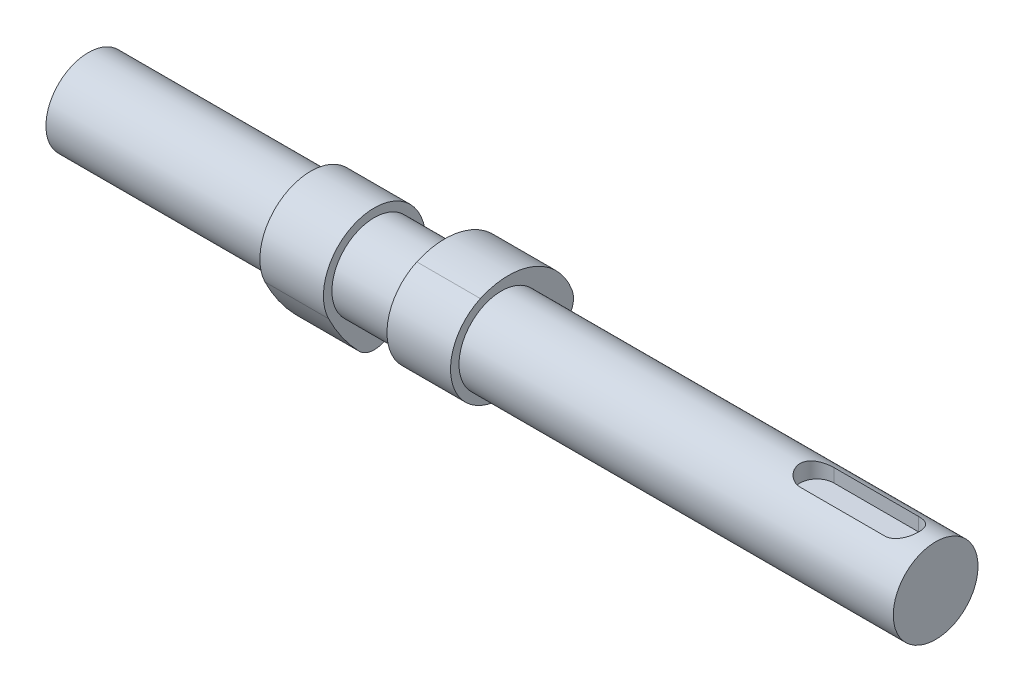
ISO-10303-21;
HEADER;
FILE_DESCRIPTION(('STEP AP214'),'2;1');
FILE_NAME('part.step','',(''),(''),'','','');
FILE_SCHEMA(('AUTOMOTIVE_DESIGN { 1 0 10303 214 1 1 1 1 }'));
ENDSEC;
DATA;
#1=APPLICATION_CONTEXT('core data for automotive mechanical design processes');
#2=APPLICATION_PROTOCOL_DEFINITION('international standard','automotive_design',2000,#1);
#3=PRODUCT_CONTEXT('',#1,'mechanical');
#4=PRODUCT('Part','Part','',(#3));
#5=PRODUCT_RELATED_PRODUCT_CATEGORY('part','',(#4));
#6=PRODUCT_DEFINITION_FORMATION('','',#4);
#7=PRODUCT_DEFINITION_CONTEXT('part definition',#1,'design');
#8=PRODUCT_DEFINITION('design','',#6,#7);
#9=PRODUCT_DEFINITION_SHAPE('','',#8);
#10=(LENGTH_UNIT() NAMED_UNIT(*) SI_UNIT(.MILLI.,.METRE.));
#11=(NAMED_UNIT(*) PLANE_ANGLE_UNIT() SI_UNIT($,.RADIAN.));
#12=(NAMED_UNIT(*) SI_UNIT($,.STERADIAN.) SOLID_ANGLE_UNIT());
#13=UNCERTAINTY_MEASURE_WITH_UNIT(LENGTH_MEASURE(1.E-05),#10,'distance_accuracy_value','');
#14=(GEOMETRIC_REPRESENTATION_CONTEXT(3) GLOBAL_UNCERTAINTY_ASSIGNED_CONTEXT((#13)) GLOBAL_UNIT_ASSIGNED_CONTEXT((#10,
#11,#12)) REPRESENTATION_CONTEXT('',''));
#15=CARTESIAN_POINT('',(0.,0.,0.));
#16=DIRECTION('',(0.,0.,1.));
#17=DIRECTION('',(1.,0.,0.));
#18=AXIS2_PLACEMENT_3D('',#15,#16,#17);
#19=CARTESIAN_POINT('',(-7.5,-1.65027279490968,3.64370686285011));
#20=DIRECTION('',(-1.,0.,0.));
#21=DIRECTION('',(0.,1.,0.));
#22=AXIS2_PLACEMENT_3D('',#19,#20,#21);
#23=CYLINDRICAL_SURFACE('',#22,16.);
#24=CARTESIAN_POINT('',(-22.5,-1.65027279490968,3.64370686285011));
#25=DIRECTION('',(1.,0.,0.));
#26=DIRECTION('',(0.,1.,0.));
#27=AXIS2_PLACEMENT_3D('',#24,#25,#26);
#28=CIRCLE('',#27,16.);
#29=CARTESIAN_POINT('',(-22.5,-16.7469832012361,-1.65623039220453));
#30=VERTEX_POINT('',#29);
#31=CARTESIAN_POINT('',(-22.5,4.95081838472905,-10.9311205885503));
#32=VERTEX_POINT('',#31);
#33=EDGE_CURVE('E107',#30,#32,#28,.T.);
#34=ORIENTED_EDGE('',*,*,#33,.T.);
#35=DIRECTION('',(-1.,0.,0.));
#36=VECTOR('',#35,1.);
#37=CARTESIAN_POINT('',(-7.5,4.95081838472905,-10.9311205885503));
#38=LINE('',#37,#36);
#39=CARTESIAN_POINT('',(-7.5,4.95081838472905,-10.9311205885503));
#40=VERTEX_POINT('',#39);
#41=EDGE_CURVE('E12',#40,#32,#38,.T.);
#42=ORIENTED_EDGE('',*,*,#41,.F.);
#43=CARTESIAN_POINT('',(-7.5,-1.65027279490968,3.64370686285011));
#44=DIRECTION('',(1.,0.,0.));
#45=DIRECTION('',(0.,1.,0.));
#46=AXIS2_PLACEMENT_3D('',#43,#44,#45);
#47=CIRCLE('',#46,16.);
#48=CARTESIAN_POINT('',(-7.5,-16.7469832012361,-1.65623039220453));
#49=VERTEX_POINT('',#48);
#50=EDGE_CURVE('E95',#49,#40,#47,.T.);
#51=ORIENTED_EDGE('',*,*,#50,.F.);
#52=DIRECTION('',(-1.,0.,0.));
#53=VECTOR('',#52,1.);
#54=CARTESIAN_POINT('',(-7.5,-16.7469832012361,-1.65623039220453));
#55=LINE('',#54,#53);
#56=EDGE_CURVE('E103',#49,#30,#55,.T.);
#57=ORIENTED_EDGE('',*,*,#56,.T.);
#58=EDGE_LOOP('',(#34,#42,#51,#57));
#59=FACE_BOUND('',#58,.T.);
#60=ADVANCED_FACE('F44',(#59),#23,.T.);
#61=CARTESIAN_POINT('',(-7.5,0.,0.));
#62=DIRECTION('',(-1.,0.,0.));
#63=DIRECTION('',(0.,1.,0.));
#64=AXIS2_PLACEMENT_3D('',#61,#62,#63);
#65=CYLINDRICAL_SURFACE('',#64,12.);
#66=CARTESIAN_POINT('',(-22.5,0.,0.));
#67=DIRECTION('',(1.,0.,0.));
#68=DIRECTION('',(0.,-1.,0.));
#69=AXIS2_PLACEMENT_3D('',#66,#67,#68);
#70=CIRCLE('',#69,12.);
#71=CARTESIAN_POINT('',(-22.5,-5.27814522008303,10.7768818790833));
#72=VERTEX_POINT('',#71);
#73=EDGE_CURVE('E99',#32,#72,#70,.T.);
#74=ORIENTED_EDGE('',*,*,#73,.T.);
#75=DIRECTION('',(-1.,0.,0.));
#76=VECTOR('',#75,1.);
#77=CARTESIAN_POINT('',(-7.5,-5.27814522008303,10.7768818790833));
#78=LINE('',#77,#76);
#79=CARTESIAN_POINT('',(-7.5,-5.27814522008303,10.7768818790833));
#80=VERTEX_POINT('',#79);
#81=EDGE_CURVE('E52',#80,#72,#78,.T.);
#82=ORIENTED_EDGE('',*,*,#81,.F.);
#83=CARTESIAN_POINT('',(-7.5,0.,0.));
#84=DIRECTION('',(1.,0.,0.));
#85=DIRECTION('',(0.,-1.,0.));
#86=AXIS2_PLACEMENT_3D('',#83,#84,#85);
#87=CIRCLE('',#86,12.);
#88=EDGE_CURVE('E90',#40,#80,#87,.T.);
#89=ORIENTED_EDGE('',*,*,#88,.F.);
#90=ORIENTED_EDGE('',*,*,#41,.T.);
#91=EDGE_LOOP('',(#74,#82,#89,#90));
#92=FACE_BOUND('',#91,.T.);
#93=ADVANCED_FACE('F98',(#92),#65,.T.);
#94=CARTESIAN_POINT('',(-7.5,12.3156721801937,-25.1460577178611));
#95=DIRECTION('',(-1.,0.,0.));
#96=DIRECTION('',(0.,1.,0.));
#97=AXIS2_PLACEMENT_3D('',#94,#95,#96);
#98=CYLINDRICAL_SURFACE('',#97,40.);
#99=CARTESIAN_POINT('',(-22.5,12.3156721801937,-25.1460577178611));
#100=DIRECTION('',(1.,0.,0.));
#101=DIRECTION('',(0.,-1.,0.));
#102=AXIS2_PLACEMENT_3D('',#99,#100,#101);
#103=CIRCLE('',#102,40.);
#104=CARTESIAN_POINT('',(-22.5,-15.5071088248952,3.59229395969449));
#105=VERTEX_POINT('',#104);
#106=EDGE_CURVE('E77',#72,#105,#103,.T.);
#107=ORIENTED_EDGE('',*,*,#106,.T.);
#108=DIRECTION('',(-1.,0.,0.));
#109=VECTOR('',#108,1.);
#110=CARTESIAN_POINT('',(-7.5,-15.5071088248952,3.59229395969449));
#111=LINE('',#110,#109);
#112=CARTESIAN_POINT('',(-7.5,-15.5071088248952,3.59229395969449));
#113=VERTEX_POINT('',#112);
#114=EDGE_CURVE('E100',#113,#105,#111,.T.);
#115=ORIENTED_EDGE('',*,*,#114,.F.);
#116=CARTESIAN_POINT('',(-7.5,12.3156721801937,-25.1460577178611));
#117=DIRECTION('',(1.,0.,0.));
#118=DIRECTION('',(0.,-1.,0.));
#119=AXIS2_PLACEMENT_3D('',#116,#117,#118);
#120=CIRCLE('',#119,40.);
#121=EDGE_CURVE('E93',#80,#113,#120,.T.);
#122=ORIENTED_EDGE('',*,*,#121,.F.);
#123=ORIENTED_EDGE('',*,*,#81,.T.);
#124=EDGE_LOOP('',(#107,#115,#122,#123));
#125=FACE_BOUND('',#124,.T.);
#126=ADVANCED_FACE('F101',(#125),#98,.T.);
#127=CARTESIAN_POINT('',(-7.5,-12.0292611992591,0.));
#128=DIRECTION('',(-1.,0.,0.));
#129=DIRECTION('',(0.,1.,0.));
#130=AXIS2_PLACEMENT_3D('',#127,#128,#129);
#131=CYLINDRICAL_SURFACE('',#130,4.99999999999999);
#132=CARTESIAN_POINT('',(-22.5,-12.0292611992591,0.));
#133=DIRECTION('',(1.,0.,0.));
#134=DIRECTION('',(0.,-1.,0.));
#135=AXIS2_PLACEMENT_3D('',#132,#133,#134);
#136=CIRCLE('',#135,4.99999999999999);
#137=EDGE_CURVE('E83',#105,#30,#136,.T.);
#138=ORIENTED_EDGE('',*,*,#137,.T.);
#139=ORIENTED_EDGE('',*,*,#56,.F.);
#140=CARTESIAN_POINT('',(-7.5,-12.0292611992591,0.));
#141=DIRECTION('',(1.,0.,0.));
#142=DIRECTION('',(0.,-1.,0.));
#143=AXIS2_PLACEMENT_3D('',#140,#141,#142);
#144=CIRCLE('',#143,4.99999999999999);
#145=EDGE_CURVE('E60',#113,#49,#144,.T.);
#146=ORIENTED_EDGE('',*,*,#145,.F.);
#147=ORIENTED_EDGE('',*,*,#114,.T.);
#148=EDGE_LOOP('',(#138,#139,#146,#147));
#149=FACE_BOUND('',#148,.T.);
#150=ADVANCED_FACE('F114',(#149),#131,.T.);
#151=CARTESIAN_POINT('',(-7.5,-6.83976699708438,1.82185343142508));
#152=DIRECTION('',(-1.,0.,0.));
#153=DIRECTION('',(0.,1.,0.));
#154=AXIS2_PLACEMENT_3D('',#151,#152,#153);
#155=PLANE('',#154);
#156=ORIENTED_EDGE('',*,*,#50,.T.);
#157=ORIENTED_EDGE('',*,*,#88,.T.);
#158=ORIENTED_EDGE('',*,*,#121,.T.);
#159=ORIENTED_EDGE('',*,*,#145,.T.);
#160=EDGE_LOOP('',(#156,#157,#158,#159));
#161=FACE_BOUND('',#160,.T.);
#162=ADVANCED_FACE('F91',(#161),#155,.F.);
#163=CARTESIAN_POINT('',(-22.5,-6.83976699708438,1.82185343142508));
#164=DIRECTION('',(-1.,0.,0.));
#165=DIRECTION('',(0.,1.,0.));
#166=AXIS2_PLACEMENT_3D('',#163,#164,#165);
#167=PLANE('',#166);
#168=ORIENTED_EDGE('',*,*,#33,.F.);
#169=ORIENTED_EDGE('',*,*,#137,.F.);
#170=ORIENTED_EDGE('',*,*,#106,.F.);
#171=ORIENTED_EDGE('',*,*,#73,.F.);
#172=EDGE_LOOP('',(#168,#169,#170,#171));
#173=FACE_BOUND('',#172,.T.);
#174=ADVANCED_FACE('F117',(#173),#167,.T.);
#175=CLOSED_SHELL('',(#60,#93,#126,#150,#162,#174));
#176=MANIFOLD_SOLID_BREP('B2',#175);
#177=CARTESIAN_POINT('',(22.5,-3.6437068628501,-1.6502727949097));
#178=DIRECTION('',(-1.,0.,0.));
#179=DIRECTION('',(0.,0.,1.));
#180=AXIS2_PLACEMENT_3D('',#177,#178,#179);
#181=CYLINDRICAL_SURFACE('',#180,16.);
#182=CARTESIAN_POINT('',(7.5,-3.6437068628501,-1.6502727949097));
#183=DIRECTION('',(1.,0.,0.));
#184=DIRECTION('',(0.,0.,1.));
#185=AXIS2_PLACEMENT_3D('',#182,#183,#184);
#186=CIRCLE('',#185,16.);
#187=CARTESIAN_POINT('',(7.5,1.65623039220459,-16.7469832012361));
#188=VERTEX_POINT('',#187);
#189=CARTESIAN_POINT('',(7.5,10.9311205885503,4.95081838472909));
#190=VERTEX_POINT('',#189);
#191=EDGE_CURVE('E240',#188,#190,#186,.T.);
#192=ORIENTED_EDGE('',*,*,#191,.T.);
#193=DIRECTION('',(-1.,0.,0.));
#194=VECTOR('',#193,1.);
#195=CARTESIAN_POINT('',(22.5,10.9311205885503,4.95081838472909));
#196=LINE('',#195,#194);
#197=CARTESIAN_POINT('',(22.5,10.9311205885503,4.95081838472909));
#198=VERTEX_POINT('',#197);
#199=EDGE_CURVE('E42',#198,#190,#196,.T.);
#200=ORIENTED_EDGE('',*,*,#199,.F.);
#201=CARTESIAN_POINT('',(22.5,-3.6437068628501,-1.6502727949097));
#202=DIRECTION('',(1.,0.,0.));
#203=DIRECTION('',(0.,0.,1.));
#204=AXIS2_PLACEMENT_3D('',#201,#202,#203);
#205=CIRCLE('',#204,16.);
#206=CARTESIAN_POINT('',(22.5,1.65623039220459,-16.7469832012361));
#207=VERTEX_POINT('',#206);
#208=EDGE_CURVE('E228',#207,#198,#205,.T.);
#209=ORIENTED_EDGE('',*,*,#208,.F.);
#210=DIRECTION('',(-1.,0.,0.));
#211=VECTOR('',#210,1.);
#212=CARTESIAN_POINT('',(22.5,1.65623039220459,-16.7469832012361));
#213=LINE('',#212,#211);
#214=EDGE_CURVE('E236',#207,#188,#213,.T.);
#215=ORIENTED_EDGE('',*,*,#214,.T.);
#216=EDGE_LOOP('',(#192,#200,#209,#215));
#217=FACE_BOUND('',#216,.T.);
#218=ADVANCED_FACE('F177',(#217),#181,.T.);
#219=CARTESIAN_POINT('',(22.5,0.,0.));
#220=DIRECTION('',(-1.,0.,0.));
#221=DIRECTION('',(0.,0.,1.));
#222=AXIS2_PLACEMENT_3D('',#219,#220,#221);
#223=CYLINDRICAL_SURFACE('',#222,12.);
#224=CARTESIAN_POINT('',(7.5,0.,0.));
#225=DIRECTION('',(1.,0.,0.));
#226=DIRECTION('',(0.,0.,-1.));
#227=AXIS2_PLACEMENT_3D('',#224,#225,#226);
#228=CIRCLE('',#227,12.);
#229=CARTESIAN_POINT('',(7.5,-10.7768818790833,-5.27814522008307));
#230=VERTEX_POINT('',#229);
#231=EDGE_CURVE('E232',#190,#230,#228,.T.);
#232=ORIENTED_EDGE('',*,*,#231,.T.);
#233=DIRECTION('',(-1.,0.,0.));
#234=VECTOR('',#233,1.);
#235=CARTESIAN_POINT('',(22.5,-10.7768818790833,-5.27814522008307));
#236=LINE('',#235,#234);
#237=CARTESIAN_POINT('',(22.5,-10.7768818790833,-5.27814522008307));
#238=VERTEX_POINT('',#237);
#239=EDGE_CURVE('E185',#238,#230,#236,.T.);
#240=ORIENTED_EDGE('',*,*,#239,.F.);
#241=CARTESIAN_POINT('',(22.5,0.,0.));
#242=DIRECTION('',(1.,0.,0.));
#243=DIRECTION('',(0.,0.,-1.));
#244=AXIS2_PLACEMENT_3D('',#241,#242,#243);
#245=CIRCLE('',#244,12.);
#246=EDGE_CURVE('E223',#198,#238,#245,.T.);
#247=ORIENTED_EDGE('',*,*,#246,.F.);
#248=ORIENTED_EDGE('',*,*,#199,.T.);
#249=EDGE_LOOP('',(#232,#240,#247,#248));
#250=FACE_BOUND('',#249,.T.);
#251=ADVANCED_FACE('F231',(#250),#223,.T.);
#252=CARTESIAN_POINT('',(22.5,25.1460577178611,12.3156721801938));
#253=DIRECTION('',(-1.,0.,0.));
#254=DIRECTION('',(0.,0.,1.));
#255=AXIS2_PLACEMENT_3D('',#252,#253,#254);
#256=CYLINDRICAL_SURFACE('',#255,40.);
#257=CARTESIAN_POINT('',(7.5,25.1460577178611,12.3156721801938));
#258=DIRECTION('',(1.,0.,0.));
#259=DIRECTION('',(0.,0.,-1.));
#260=AXIS2_PLACEMENT_3D('',#257,#258,#259);
#261=CIRCLE('',#260,40.);
#262=CARTESIAN_POINT('',(7.5,-3.59229395969443,-15.5071088248952));
#263=VERTEX_POINT('',#262);
#264=EDGE_CURVE('E210',#230,#263,#261,.T.);
#265=ORIENTED_EDGE('',*,*,#264,.T.);
#266=DIRECTION('',(-1.,0.,0.));
#267=VECTOR('',#266,1.);
#268=CARTESIAN_POINT('',(22.5,-3.59229395969443,-15.5071088248952));
#269=LINE('',#268,#267);
#270=CARTESIAN_POINT('',(22.5,-3.59229395969443,-15.5071088248952));
#271=VERTEX_POINT('',#270);
#272=EDGE_CURVE('E233',#271,#263,#269,.T.);
#273=ORIENTED_EDGE('',*,*,#272,.F.);
#274=CARTESIAN_POINT('',(22.5,25.1460577178611,12.3156721801938));
#275=DIRECTION('',(1.,0.,0.));
#276=DIRECTION('',(0.,0.,-1.));
#277=AXIS2_PLACEMENT_3D('',#274,#275,#276);
#278=CIRCLE('',#277,40.);
#279=EDGE_CURVE('E226',#238,#271,#278,.T.);
#280=ORIENTED_EDGE('',*,*,#279,.F.);
#281=ORIENTED_EDGE('',*,*,#239,.T.);
#282=EDGE_LOOP('',(#265,#273,#280,#281));
#283=FACE_BOUND('',#282,.T.);
#284=ADVANCED_FACE('F234',(#283),#256,.T.);
#285=CARTESIAN_POINT('',(22.5,0.,-12.0292611992591));
#286=DIRECTION('',(-1.,0.,0.));
#287=DIRECTION('',(0.,0.,1.));
#288=AXIS2_PLACEMENT_3D('',#285,#286,#287);
#289=CYLINDRICAL_SURFACE('',#288,4.99999999999999);
#290=CARTESIAN_POINT('',(7.5,0.,-12.0292611992591));
#291=DIRECTION('',(1.,0.,0.));
#292=DIRECTION('',(0.,0.,-1.));
#293=AXIS2_PLACEMENT_3D('',#290,#291,#292);
#294=CIRCLE('',#293,4.99999999999999);
#295=EDGE_CURVE('E216',#263,#188,#294,.T.);
#296=ORIENTED_EDGE('',*,*,#295,.T.);
#297=ORIENTED_EDGE('',*,*,#214,.F.);
#298=CARTESIAN_POINT('',(22.5,0.,-12.0292611992591));
#299=DIRECTION('',(1.,0.,0.));
#300=DIRECTION('',(0.,0.,-1.));
#301=AXIS2_PLACEMENT_3D('',#298,#299,#300);
#302=CIRCLE('',#301,4.99999999999999);
#303=EDGE_CURVE('E193',#271,#207,#302,.T.);
#304=ORIENTED_EDGE('',*,*,#303,.F.);
#305=ORIENTED_EDGE('',*,*,#272,.T.);
#306=EDGE_LOOP('',(#296,#297,#304,#305));
#307=FACE_BOUND('',#306,.T.);
#308=ADVANCED_FACE('F247',(#307),#289,.T.);
#309=CARTESIAN_POINT('',(22.5,-1.82185343142505,-6.83976699708439));
#310=DIRECTION('',(-1.,0.,0.));
#311=DIRECTION('',(0.,0.,1.));
#312=AXIS2_PLACEMENT_3D('',#309,#310,#311);
#313=PLANE('',#312);
#314=ORIENTED_EDGE('',*,*,#208,.T.);
#315=ORIENTED_EDGE('',*,*,#246,.T.);
#316=ORIENTED_EDGE('',*,*,#279,.T.);
#317=ORIENTED_EDGE('',*,*,#303,.T.);
#318=EDGE_LOOP('',(#314,#315,#316,#317));
#319=FACE_BOUND('',#318,.T.);
#320=ADVANCED_FACE('F224',(#319),#313,.F.);
#321=CARTESIAN_POINT('',(7.5,-1.82185343142505,-6.83976699708439));
#322=DIRECTION('',(-1.,0.,0.));
#323=DIRECTION('',(0.,0.,1.));
#324=AXIS2_PLACEMENT_3D('',#321,#322,#323);
#325=PLANE('',#324);
#326=ORIENTED_EDGE('',*,*,#191,.F.);
#327=ORIENTED_EDGE('',*,*,#295,.F.);
#328=ORIENTED_EDGE('',*,*,#264,.F.);
#329=ORIENTED_EDGE('',*,*,#231,.F.);
#330=EDGE_LOOP('',(#326,#327,#328,#329));
#331=FACE_BOUND('',#330,.T.);
#332=ADVANCED_FACE('F250',(#331),#325,.T.);
#333=CLOSED_SHELL('',(#218,#251,#284,#308,#320,#332));
#334=MANIFOLD_SOLID_BREP('B6',#333);
#335=CARTESIAN_POINT('',(125.,0.,0.));
#336=DIRECTION('',(-1.,0.,0.));
#337=DIRECTION('',(0.,0.,1.));
#338=AXIS2_PLACEMENT_3D('',#335,#336,#337);
#339=CYLINDRICAL_SURFACE('',#338,10.);
#340=DIRECTION('',(-1.,0.,0.));
#341=VECTOR('',#340,1.);
#342=CARTESIAN_POINT('',(125.,9.16515138991168,-4.));
#343=LINE('',#342,#341);
#344=CARTESIAN_POINT('',(97.,9.16515138991168,-4.));
#345=VERTEX_POINT('',#344);
#346=CARTESIAN_POINT('',(117.,9.16515138991168,-4.));
#347=VERTEX_POINT('',#346);
#348=EDGE_CURVE('E175',#345,#347,#343,.F.);
#349=ORIENTED_EDGE('',*,*,#348,.T.);
#350=CARTESIAN_POINT('',(117.,9.16515138991168,-4.));
#351=CARTESIAN_POINT('',(117.107611705054,9.16512928809544,-4.00001596071937));
#352=CARTESIAN_POINT('',(117.215211331167,9.16704612011429,-3.99565782731266));
#353=CARTESIAN_POINT('',(117.429542596539,9.17459250745478,-3.9783181194646));
#354=CARTESIAN_POINT('',(117.536274550717,9.18022064873058,-3.96533982937531));
#355=CARTESIAN_POINT('',(117.747693643106,9.19499565865171,-3.93095207352899));
#356=CARTESIAN_POINT('',(117.852387168085,9.20412861441611,-3.90957593640916));
#357=CARTESIAN_POINT('',(118.059401543432,9.22560106586818,-3.85863260381273));
#358=CARTESIAN_POINT('',(118.161722248555,9.23794075728508,-3.82906490834148));
#359=CARTESIAN_POINT('',(118.463871701162,9.2791858250141,-3.72853943587112));
#360=CARTESIAN_POINT('',(118.659308461383,9.3123489831615,-3.64568978920222));
#361=CARTESIAN_POINT('',(119.033591160162,9.38624741529469,-3.45096383184147));
#362=CARTESIAN_POINT('',(119.212421105909,9.42698987727426,-3.33905992673094));
#363=CARTESIAN_POINT('',(119.558524793364,9.51401998804847,-3.08263671474506));
#364=CARTESIAN_POINT('',(119.7247344339,9.56048491272144,-2.936738279885));
#365=CARTESIAN_POINT('',(120.031080544362,9.65225581096199,-2.61939292349378));
#366=CARTESIAN_POINT('',(120.171211661507,9.69756154495612,-2.44794076987998));
#367=CARTESIAN_POINT('',(120.426812788624,9.78406834216145,-2.07601181629754));
#368=CARTESIAN_POINT('',(120.54108961941,9.82503649102096,-1.87465586655103));
#369=CARTESIAN_POINT('',(120.733688144491,9.89607888234979,-1.45364828604453));
#370=CARTESIAN_POINT('',(120.812024844793,9.92615767032247,-1.23400433637532));
#371=CARTESIAN_POINT('',(120.926682405771,9.97076629361036,-0.793934884187375));
#372=CARTESIAN_POINT('',(120.964853913303,9.98597845290694,-0.574062114869026));
#373=CARTESIAN_POINT('',(121.004056948403,10.001606202074,-0.130536855092207));
#374=CARTESIAN_POINT('',(121.005101633252,10.0020270338048,0.0931142682526773));
#375=CARTESIAN_POINT('',(120.971034362072,9.98843920775428,0.524466731987233));
#376=CARTESIAN_POINT('',(120.937950053447,9.97523973659777,0.732358330632754));
#377=CARTESIAN_POINT('',(120.84001299909,9.93698538393897,1.13934964738689));
#378=CARTESIAN_POINT('',(120.77515845543,9.91192983148495,1.33844886722559));
#379=CARTESIAN_POINT('',(120.614727962228,9.85193670608706,1.72579479688348));
#380=CARTESIAN_POINT('',(120.518703604161,9.81685584875391,1.91383264586891));
#381=CARTESIAN_POINT('',(120.299068736295,9.74029168639969,2.2716159956307));
#382=CARTESIAN_POINT('',(120.175448548562,9.69880613681324,2.4413550479227));
#383=CARTESIAN_POINT('',(119.894719942564,9.61043706268122,2.7695225783069));
#384=CARTESIAN_POINT('',(119.735946982884,9.56337795745419,2.92647922614483));
#385=CARTESIAN_POINT('',(119.394007863337,9.47123359153046,3.2122147086262));
#386=CARTESIAN_POINT('',(119.2108306512,9.42614923753061,3.34098070594789));
#387=CARTESIAN_POINT('',(118.918364354377,9.36326134539254,3.51186134851389));
#388=CARTESIAN_POINT('',(118.816328161685,9.34283170142194,3.56571263251516));
#389=CARTESIAN_POINT('',(118.607607697591,9.30450957703984,3.6645476150566));
#390=CARTESIAN_POINT('',(118.500925454273,9.28661600381593,3.70953513634087));
#391=CARTESIAN_POINT('',(118.283771069504,9.25400250539921,3.79016254319008));
#392=CARTESIAN_POINT('',(118.173303829959,9.2392786427695,3.82581403809399));
#393=CARTESIAN_POINT('',(117.949331631851,9.2135146773091,3.88744848158464));
#394=CARTESIAN_POINT('',(117.835828059787,9.20247292309662,3.91343576505912));
#395=CARTESIAN_POINT('',(117.602554552662,9.18417798205495,3.95619393609846));
#396=CARTESIAN_POINT('',(117.482705805436,9.17707470750587,3.9726012558417));
#397=CARTESIAN_POINT('',(117.241909070863,9.16754485606458,3.99451448409732));
#398=CARTESIAN_POINT('',(117.120961807077,9.16511539745838,4.0000271099601));
#399=CARTESIAN_POINT('',(117.,9.16515138991168,4.));
#400=B_SPLINE_CURVE_WITH_KNOTS('',3,(#350,#351,#352,#353,#354,#355,#356,#357,#358,#359,#360,
#361,#362,#363,#364,#365,#366,#367,#368,#369,#370,#371,#372,#373,#374,#375,#376,#377,#378,#379,
#380,#381,#382,#383,#384,#385,#386,#387,#388,#389,#390,#391,#392,#393,#394,#395,#396,#397,#398,
#399),.UNSPECIFIED.,.F.,.F.,(4,2,2,2,2,2,2,2,2,2,2,2,2,2,2,2,2,2,2,2,2,2,2,2,4),(0.,
0.322709706217834,0.645296527806424,0.96661582254376,1.28795473422461,1.9293660035182,
2.57138869889252,3.24636095994996,3.92147161082381,4.62325717855526,5.32474946398644,
5.99227753012539,6.65956903033311,7.2893783052307,7.91922322615309,8.55856353859093,
9.19812842270037,9.87963749353244,10.5614562641081,10.9125878460839,11.2635676597188,
11.614108935291,11.964492785171,12.3274303244848,12.6901440171997),.UNSPECIFIED.);
#401=CARTESIAN_POINT('',(117.,9.16515138991168,4.));
#402=VERTEX_POINT('',#401);
#403=EDGE_CURVE('E376',#347,#402,#400,.T.);
#404=ORIENTED_EDGE('',*,*,#403,.T.);
#405=DIRECTION('',(-1.,0.,0.));
#406=VECTOR('',#405,1.);
#407=CARTESIAN_POINT('',(125.,9.16515138991168,4.));
#408=LINE('',#407,#406);
#409=CARTESIAN_POINT('',(97.,9.16515138991168,4.));
#410=VERTEX_POINT('',#409);
#411=EDGE_CURVE('E309',#402,#410,#408,.T.);
#412=ORIENTED_EDGE('',*,*,#411,.T.);
#413=CARTESIAN_POINT('',(97.,9.16515138991168,4.));
#414=CARTESIAN_POINT('',(96.8923882949458,9.16512928809544,4.00001596071937));
#415=CARTESIAN_POINT('',(96.7847886688333,9.16704612011429,3.99565782731266));
#416=CARTESIAN_POINT('',(96.5704574034612,9.17459250745478,3.9783181194646));
#417=CARTESIAN_POINT('',(96.4637254492831,9.18022064873058,3.96533982937531));
#418=CARTESIAN_POINT('',(96.2523063568937,9.19499565865171,3.93095207352899));
#419=CARTESIAN_POINT('',(96.1476128319149,9.20412861441611,3.90957593640916));
#420=CARTESIAN_POINT('',(95.9405984565681,9.22560106586818,3.85863260381273));
#421=CARTESIAN_POINT('',(95.8382777514449,9.23794075728508,3.82906490834148));
#422=CARTESIAN_POINT('',(95.5361282988375,9.2791858250141,3.72853943587112));
#423=CARTESIAN_POINT('',(95.3406915386172,9.3123489831615,3.64568978920222));
#424=CARTESIAN_POINT('',(94.9664088398381,9.38624741529469,3.45096383184147));
#425=CARTESIAN_POINT('',(94.7875788940914,9.42698987727426,3.33905992673094));
#426=CARTESIAN_POINT('',(94.441475206636,9.51401998804847,3.08263671474506));
#427=CARTESIAN_POINT('',(94.2752655660996,9.56048491272144,2.93673827988501));
#428=CARTESIAN_POINT('',(93.9689194556385,9.65225581096199,2.61939292349378));
#429=CARTESIAN_POINT('',(93.8287883384928,9.69756154495612,2.44794076987999));
#430=CARTESIAN_POINT('',(93.5731872113755,9.78406834216145,2.07601181629754));
#431=CARTESIAN_POINT('',(93.4589103805898,9.82503649102096,1.87465586655103));
#432=CARTESIAN_POINT('',(93.2663118555086,9.89607888234979,1.45364828604453));
#433=CARTESIAN_POINT('',(93.1879751552067,9.92615767032247,1.23400433637532));
#434=CARTESIAN_POINT('',(93.0733175942291,9.97076629361036,0.793934884187376));
#435=CARTESIAN_POINT('',(93.0351460866969,9.98597845290694,0.574062114869027));
#436=CARTESIAN_POINT('',(92.9959430515965,10.001606202074,0.130536855092208));
#437=CARTESIAN_POINT('',(92.9948983667482,10.0020270338048,-0.0931142682526768));
#438=CARTESIAN_POINT('',(93.0289656379282,9.98843920775428,-0.524466731987233));
#439=CARTESIAN_POINT('',(93.0620499465532,9.97523973659777,-0.732358330632754));
#440=CARTESIAN_POINT('',(93.1599870009102,9.93698538393897,-1.13934964738689));
#441=CARTESIAN_POINT('',(93.2248415445704,9.91192983148495,-1.33844886722559));
#442=CARTESIAN_POINT('',(93.3852720377719,9.85193670608706,-1.72579479688349));
#443=CARTESIAN_POINT('',(93.481296395839,9.81685584875391,-1.91383264586891));
#444=CARTESIAN_POINT('',(93.7009312637048,9.74029168639969,-2.27161599563071));
#445=CARTESIAN_POINT('',(93.8245514514378,9.69880613681324,-2.4413550479227));
#446=CARTESIAN_POINT('',(94.1052800574364,9.61043706268122,-2.7695225783069));
#447=CARTESIAN_POINT('',(94.2640530171164,9.56337795745419,-2.92647922614483));
#448=CARTESIAN_POINT('',(94.6059921366628,9.47123359153046,-3.2122147086262));
#449=CARTESIAN_POINT('',(94.7891693487996,9.42614923753061,-3.34098070594789));
#450=CARTESIAN_POINT('',(95.0816356456234,9.36326134539254,-3.51186134851389));
#451=CARTESIAN_POINT('',(95.1836718383149,9.34283170142194,-3.56571263251515));
#452=CARTESIAN_POINT('',(95.3923923024092,9.30450957703985,-3.66454761505659));
#453=CARTESIAN_POINT('',(95.4990745457273,9.28661600381593,-3.70953513634086));
#454=CARTESIAN_POINT('',(95.7162289304962,9.25400250539921,-3.79016254319007));
#455=CARTESIAN_POINT('',(95.8266961700413,9.2392786427695,-3.82581403809398));
#456=CARTESIAN_POINT('',(96.0506683681487,9.2135146773091,-3.88744848158463));
#457=CARTESIAN_POINT('',(96.1641719402125,9.20247292309662,-3.91343576505912));
#458=CARTESIAN_POINT('',(96.3974454473375,9.18417798205495,-3.95619393609845));
#459=CARTESIAN_POINT('',(96.5172941945638,9.17707470750587,-3.9726012558417));
#460=CARTESIAN_POINT('',(96.758090929137,9.16754485606457,-3.99451448409732));
#461=CARTESIAN_POINT('',(96.8790381929227,9.16511539745838,-4.0000271099601));
#462=CARTESIAN_POINT('',(97.,9.16515138991168,-4.));
#463=B_SPLINE_CURVE_WITH_KNOTS('',3,(#413,#414,#415,#416,#417,#418,#419,#420,#421,#422,#423,
#424,#425,#426,#427,#428,#429,#430,#431,#432,#433,#434,#435,#436,#437,#438,#439,#440,#441,#442,
#443,#444,#445,#446,#447,#448,#449,#450,#451,#452,#453,#454,#455,#456,#457,#458,#459,#460,#461,
#462),.UNSPECIFIED.,.F.,.F.,(4,2,2,2,2,2,2,2,2,2,2,2,2,2,2,2,2,2,2,2,2,2,2,2,4),(0.,
0.322709706217834,0.645296527806424,0.966615822543774,1.28795473422461,1.9293660035182,
2.57138869889252,3.24636095994996,3.92147161082381,4.62325717855526,5.32474946398645,
5.99227753012539,6.65956903033311,7.2893783052307,7.91922322615309,8.55856353859093,
9.19812842270037,9.87963749353244,10.5614562641081,10.9125878460839,11.2635676597187,
11.6141089352909,11.964492785171,12.3274303244848,12.6901440171997),.UNSPECIFIED.);
#464=EDGE_CURVE('E316',#410,#345,#463,.T.);
#465=ORIENTED_EDGE('',*,*,#464,.T.);
#466=EDGE_LOOP('',(#349,#404,#412,#465));
#467=FACE_BOUND('',#466,.T.);
#468=CARTESIAN_POINT('',(125.,0.,0.));
#469=DIRECTION('',(1.,0.,0.));
#470=DIRECTION('',(0.,0.,-1.));
#471=AXIS2_PLACEMENT_3D('',#468,#469,#470);
#472=CIRCLE('',#471,10.);
#473=CARTESIAN_POINT('',(125.,0.,-10.));
#474=VERTEX_POINT('',#473);
#475=EDGE_CURVE('E373',#474,#474,#472,.T.);
#476=ORIENTED_EDGE('',*,*,#475,.F.);
#477=EDGE_LOOP('',(#476));
#478=FACE_BOUND('',#477,.T.);
#479=CARTESIAN_POINT('',(-75.,0.,0.));
#480=DIRECTION('',(1.,0.,0.));
#481=DIRECTION('',(0.,0.,-1.));
#482=AXIS2_PLACEMENT_3D('',#479,#480,#481);
#483=CIRCLE('',#482,10.);
#484=CARTESIAN_POINT('',(-75.,0.,-10.));
#485=VERTEX_POINT('',#484);
#486=EDGE_CURVE('E367',#485,#485,#483,.T.);
#487=ORIENTED_EDGE('',*,*,#486,.T.);
#488=EDGE_LOOP('',(#487));
#489=FACE_BOUND('',#488,.T.);
#490=ADVANCED_FACE('F301',(#467,#478,#489),#339,.T.);
#491=CARTESIAN_POINT('',(125.,0.,0.));
#492=DIRECTION('',(1.,0.,0.));
#493=DIRECTION('',(0.,0.,-1.));
#494=AXIS2_PLACEMENT_3D('',#491,#492,#493);
#495=PLANE('',#494);
#496=ORIENTED_EDGE('',*,*,#475,.T.);
#497=EDGE_LOOP('',(#496));
#498=FACE_BOUND('',#497,.T.);
#499=ADVANCED_FACE('F401',(#498),#495,.T.);
#500=CARTESIAN_POINT('',(-75.,0.,0.));
#501=DIRECTION('',(1.,0.,0.));
#502=DIRECTION('',(0.,0.,-1.));
#503=AXIS2_PLACEMENT_3D('',#500,#501,#502);
#504=PLANE('',#503);
#505=ORIENTED_EDGE('',*,*,#486,.F.);
#506=EDGE_LOOP('',(#505));
#507=FACE_BOUND('',#506,.T.);
#508=ADVANCED_FACE('F399',(#507),#504,.F.);
#509=CARTESIAN_POINT('',(97.,6.,0.));
#510=DIRECTION('',(0.,1.,0.));
#511=DIRECTION('',(0.,0.,1.));
#512=AXIS2_PLACEMENT_3D('',#509,#510,#511);
#513=CYLINDRICAL_SURFACE('',#512,4.);
#514=DIRECTION('',(0.,1.,0.));
#515=VECTOR('',#514,1.);
#516=CARTESIAN_POINT('',(97.,6.,4.));
#517=LINE('',#516,#515);
#518=CARTESIAN_POINT('',(97.,6.,4.));
#519=VERTEX_POINT('',#518);
#520=EDGE_CURVE('E339',#519,#410,#517,.T.);
#521=ORIENTED_EDGE('',*,*,#520,.F.);
#522=CARTESIAN_POINT('',(97.,6.,0.));
#523=DIRECTION('',(0.,1.,0.));
#524=DIRECTION('',(0.,0.,1.));
#525=AXIS2_PLACEMENT_3D('',#522,#523,#524);
#526=CIRCLE('',#525,4.);
#527=CARTESIAN_POINT('',(97.,6.,-4.));
#528=VERTEX_POINT('',#527);
#529=EDGE_CURVE('E343',#528,#519,#526,.T.);
#530=ORIENTED_EDGE('',*,*,#529,.F.);
#531=DIRECTION('',(0.,1.,0.));
#532=VECTOR('',#531,1.);
#533=CARTESIAN_POINT('',(97.,6.,-4.));
#534=LINE('',#533,#532);
#535=EDGE_CURVE('E365',#528,#345,#534,.T.);
#536=ORIENTED_EDGE('',*,*,#535,.T.);
#537=ORIENTED_EDGE('',*,*,#464,.F.);
#538=EDGE_LOOP('',(#521,#530,#536,#537));
#539=FACE_BOUND('',#538,.T.);
#540=ADVANCED_FACE('F341',(#539),#513,.F.);
#541=CARTESIAN_POINT('',(97.,6.,-4.));
#542=DIRECTION('',(0.,0.,-1.));
#543=DIRECTION('',(-1.,0.,0.));
#544=AXIS2_PLACEMENT_3D('',#541,#542,#543);
#545=PLANE('',#544);
#546=ORIENTED_EDGE('',*,*,#535,.F.);
#547=DIRECTION('',(-1.,0.,0.));
#548=VECTOR('',#547,1.);
#549=CARTESIAN_POINT('',(97.,6.,-4.));
#550=LINE('',#549,#548);
#551=CARTESIAN_POINT('',(117.,6.,-4.));
#552=VERTEX_POINT('',#551);
#553=EDGE_CURVE('E348',#552,#528,#550,.T.);
#554=ORIENTED_EDGE('',*,*,#553,.F.);
#555=DIRECTION('',(0.,1.,0.));
#556=VECTOR('',#555,1.);
#557=CARTESIAN_POINT('',(117.,6.,-4.));
#558=LINE('',#557,#556);
#559=EDGE_CURVE('E368',#552,#347,#558,.T.);
#560=ORIENTED_EDGE('',*,*,#559,.T.);
#561=ORIENTED_EDGE('',*,*,#348,.F.);
#562=EDGE_LOOP('',(#546,#554,#560,#561));
#563=FACE_BOUND('',#562,.T.);
#564=ADVANCED_FACE('F392',(#563),#545,.F.);
#565=CARTESIAN_POINT('',(117.,6.,0.));
#566=DIRECTION('',(0.,1.,0.));
#567=DIRECTION('',(0.,0.,1.));
#568=AXIS2_PLACEMENT_3D('',#565,#566,#567);
#569=CYLINDRICAL_SURFACE('',#568,4.);
#570=ORIENTED_EDGE('',*,*,#559,.F.);
#571=CARTESIAN_POINT('',(117.,6.,0.));
#572=DIRECTION('',(0.,1.,0.));
#573=DIRECTION('',(0.,0.,1.));
#574=AXIS2_PLACEMENT_3D('',#571,#572,#573);
#575=CIRCLE('',#574,4.);
#576=CARTESIAN_POINT('',(117.,6.,4.));
#577=VERTEX_POINT('',#576);
#578=EDGE_CURVE('E357',#577,#552,#575,.T.);
#579=ORIENTED_EDGE('',*,*,#578,.F.);
#580=DIRECTION('',(0.,1.,0.));
#581=VECTOR('',#580,1.);
#582=CARTESIAN_POINT('',(117.,6.,4.));
#583=LINE('',#582,#581);
#584=EDGE_CURVE('E347',#577,#402,#583,.T.);
#585=ORIENTED_EDGE('',*,*,#584,.T.);
#586=ORIENTED_EDGE('',*,*,#403,.F.);
#587=EDGE_LOOP('',(#570,#579,#585,#586));
#588=FACE_BOUND('',#587,.T.);
#589=ADVANCED_FACE('F387',(#588),#569,.F.);
#590=CARTESIAN_POINT('',(97.,6.,4.));
#591=DIRECTION('',(0.,0.,1.));
#592=DIRECTION('',(1.,0.,0.));
#593=AXIS2_PLACEMENT_3D('',#590,#591,#592);
#594=PLANE('',#593);
#595=ORIENTED_EDGE('',*,*,#584,.F.);
#596=DIRECTION('',(1.,0.,0.));
#597=VECTOR('',#596,1.);
#598=CARTESIAN_POINT('',(97.,6.,4.));
#599=LINE('',#598,#597);
#600=EDGE_CURVE('E351',#519,#577,#599,.T.);
#601=ORIENTED_EDGE('',*,*,#600,.F.);
#602=ORIENTED_EDGE('',*,*,#520,.T.);
#603=ORIENTED_EDGE('',*,*,#411,.F.);
#604=EDGE_LOOP('',(#595,#601,#602,#603));
#605=FACE_BOUND('',#604,.T.);
#606=ADVANCED_FACE('F352',(#605),#594,.F.);
#607=CARTESIAN_POINT('',(97.,6.,0.));
#608=DIRECTION('',(0.,1.,0.));
#609=DIRECTION('',(0.,0.,1.));
#610=AXIS2_PLACEMENT_3D('',#607,#608,#609);
#611=PLANE('',#610);
#612=ORIENTED_EDGE('',*,*,#529,.T.);
#613=ORIENTED_EDGE('',*,*,#600,.T.);
#614=ORIENTED_EDGE('',*,*,#578,.T.);
#615=ORIENTED_EDGE('',*,*,#553,.T.);
#616=EDGE_LOOP('',(#612,#613,#614,#615));
#617=FACE_BOUND('',#616,.T.);
#618=ADVANCED_FACE('F359',(#617),#611,.T.);
#619=CLOSED_SHELL('',(#490,#499,#508,#540,#564,#589,#606,#618));
#620=MANIFOLD_SOLID_BREP('B36',#619);
#621=ADVANCED_BREP_SHAPE_REPRESENTATION('',(#18,#176,#334,#620),#14);
#622=SHAPE_DEFINITION_REPRESENTATION(#9,#621);
ENDSEC;
END-ISO-10303-21;
